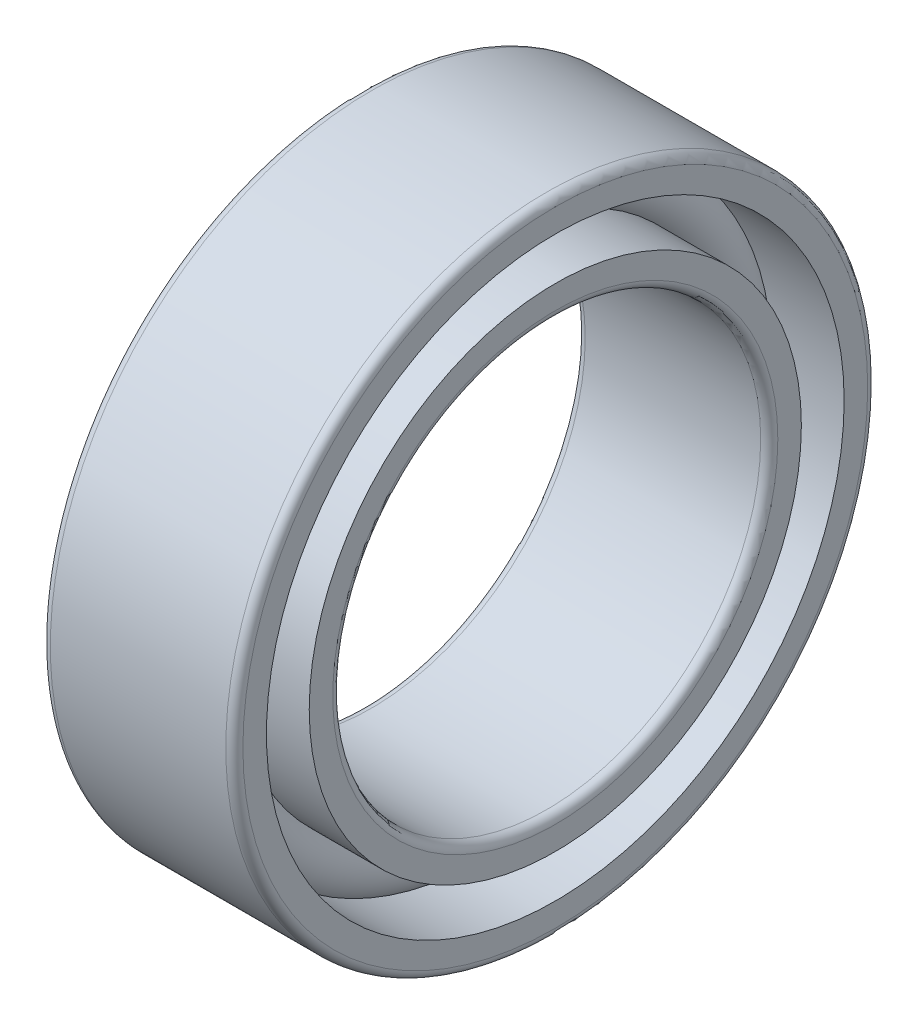
ISO-10303-21;
HEADER;
FILE_DESCRIPTION(('STEP AP214'),'2;1');
FILE_NAME('part.step','',(''),(''),'','','');
FILE_SCHEMA(('AUTOMOTIVE_DESIGN { 1 0 10303 214 1 1 1 1 }'));
ENDSEC;
DATA;
#1=APPLICATION_CONTEXT('core data for automotive mechanical design processes');
#2=APPLICATION_PROTOCOL_DEFINITION('international standard','automotive_design',2000,#1);
#3=PRODUCT_CONTEXT('',#1,'mechanical');
#4=PRODUCT('Part','Part','',(#3));
#5=PRODUCT_RELATED_PRODUCT_CATEGORY('part','',(#4));
#6=PRODUCT_DEFINITION_FORMATION('','',#4);
#7=PRODUCT_DEFINITION_CONTEXT('part definition',#1,'design');
#8=PRODUCT_DEFINITION('design','',#6,#7);
#9=PRODUCT_DEFINITION_SHAPE('','',#8);
#10=(LENGTH_UNIT() NAMED_UNIT(*) SI_UNIT(.MILLI.,.METRE.));
#11=(NAMED_UNIT(*) PLANE_ANGLE_UNIT() SI_UNIT($,.RADIAN.));
#12=(NAMED_UNIT(*) SI_UNIT($,.STERADIAN.) SOLID_ANGLE_UNIT());
#13=UNCERTAINTY_MEASURE_WITH_UNIT(LENGTH_MEASURE(1.E-05),#10,'distance_accuracy_value','');
#14=(GEOMETRIC_REPRESENTATION_CONTEXT(3) GLOBAL_UNCERTAINTY_ASSIGNED_CONTEXT((#13)) GLOBAL_UNIT_ASSIGNED_CONTEXT((#10,
#11,#12)) REPRESENTATION_CONTEXT('',''));
#15=CARTESIAN_POINT('',(0.,0.,0.));
#16=DIRECTION('',(0.,0.,1.));
#17=DIRECTION('',(1.,0.,0.));
#18=AXIS2_PLACEMENT_3D('',#15,#16,#17);
#19=CARTESIAN_POINT('',(0.,0.,0.));
#20=DIRECTION('',(-1.,0.,0.));
#21=DIRECTION('',(0.,0.,1.));
#22=AXIS2_PLACEMENT_3D('',#19,#20,#21);
#23=TOROIDAL_SURFACE('',#22,6.25,0.75);
#24=CARTESIAN_POINT('',(0.559016994374941,0.,0.));
#25=DIRECTION('',(-1.,0.,0.));
#26=DIRECTION('',(0.,0.,1.));
#27=AXIS2_PLACEMENT_3D('',#24,#25,#26);
#28=CIRCLE('',#27,6.75000000000001);
#29=CARTESIAN_POINT('',(0.559016994374941,0.,6.75000000000001));
#30=VERTEX_POINT('',#29);
#31=EDGE_CURVE('E41',#30,#30,#28,.F.);
#32=ORIENTED_EDGE('',*,*,#31,.T.);
#33=EDGE_LOOP('',(#32));
#34=FACE_BOUND('',#33,.T.);
#35=CARTESIAN_POINT('',(0.559016994374947,0.,0.));
#36=DIRECTION('',(-1.,0.,0.));
#37=DIRECTION('',(0.,0.,1.));
#38=AXIS2_PLACEMENT_3D('',#35,#36,#37);
#39=CIRCLE('',#38,5.75);
#40=CARTESIAN_POINT('',(0.559016994374947,0.,5.75));
#41=VERTEX_POINT('',#40);
#42=EDGE_CURVE('E10',#41,#41,#39,.T.);
#43=ORIENTED_EDGE('',*,*,#42,.T.);
#44=EDGE_LOOP('',(#43));
#45=FACE_BOUND('',#44,.T.);
#46=ADVANCED_FACE('F37',(#34,#45),#23,.T.);
#47=CARTESIAN_POINT('',(-20.6375,0.,0.));
#48=DIRECTION('',(1.,0.,0.));
#49=DIRECTION('',(0.,0.,-1.));
#50=AXIS2_PLACEMENT_3D('',#47,#48,#49);
#51=CYLINDRICAL_SURFACE('',#50,5.75);
#52=CARTESIAN_POINT('',(2.25,0.,0.));
#53=DIRECTION('',(1.,0.,0.));
#54=DIRECTION('',(0.,0.,-1.));
#55=AXIS2_PLACEMENT_3D('',#52,#53,#54);
#56=CIRCLE('',#55,5.75);
#57=CARTESIAN_POINT('',(2.25,0.,-5.75));
#58=VERTEX_POINT('',#57);
#59=EDGE_CURVE('E50',#58,#58,#56,.T.);
#60=ORIENTED_EDGE('',*,*,#59,.F.);
#61=EDGE_LOOP('',(#60));
#62=FACE_BOUND('',#61,.T.);
#63=ORIENTED_EDGE('',*,*,#42,.F.);
#64=EDGE_LOOP('',(#63));
#65=FACE_BOUND('',#64,.T.);
#66=ADVANCED_FACE('F89',(#62,#65),#51,.T.);
#67=CARTESIAN_POINT('',(-20.6375,0.,0.));
#68=DIRECTION('',(1.,0.,0.));
#69=DIRECTION('',(0.,0.,-1.));
#70=AXIS2_PLACEMENT_3D('',#67,#68,#69);
#71=CYLINDRICAL_SURFACE('',#70,5.75);
#72=CARTESIAN_POINT('',(-2.25,0.,0.));
#73=DIRECTION('',(1.,0.,0.));
#74=DIRECTION('',(0.,0.,-1.));
#75=AXIS2_PLACEMENT_3D('',#72,#73,#74);
#76=CIRCLE('',#75,5.75);
#77=CARTESIAN_POINT('',(-2.25,0.,-5.75));
#78=VERTEX_POINT('',#77);
#79=EDGE_CURVE('E59',#78,#78,#76,.T.);
#80=ORIENTED_EDGE('',*,*,#79,.T.);
#81=EDGE_LOOP('',(#80));
#82=FACE_BOUND('',#81,.T.);
#83=CARTESIAN_POINT('',(-0.559016994374947,0.,0.));
#84=DIRECTION('',(1.,0.,0.));
#85=DIRECTION('',(0.,0.,-1.));
#86=AXIS2_PLACEMENT_3D('',#83,#84,#85);
#87=CIRCLE('',#86,5.75);
#88=CARTESIAN_POINT('',(-0.559016994374947,0.,-5.75));
#89=VERTEX_POINT('',#88);
#90=EDGE_CURVE('E45',#89,#89,#87,.T.);
#91=ORIENTED_EDGE('',*,*,#90,.F.);
#92=EDGE_LOOP('',(#91));
#93=FACE_BOUND('',#92,.T.);
#94=ADVANCED_FACE('F92',(#82,#93),#71,.T.);
#95=CARTESIAN_POINT('',(2.25,5.2,0.));
#96=DIRECTION('',(1.,0.,0.));
#97=DIRECTION('',(0.,0.,-1.));
#98=AXIS2_PLACEMENT_3D('',#95,#96,#97);
#99=PLANE('',#98);
#100=ORIENTED_EDGE('',*,*,#59,.T.);
#101=EDGE_LOOP('',(#100));
#102=FACE_BOUND('',#101,.T.);
#103=CARTESIAN_POINT('',(2.25,0.,0.));
#104=DIRECTION('',(1.,0.,0.));
#105=DIRECTION('',(0.,0.,-1.));
#106=AXIS2_PLACEMENT_3D('',#103,#104,#105);
#107=CIRCLE('',#106,5.2);
#108=CARTESIAN_POINT('',(2.25,0.,-5.2));
#109=VERTEX_POINT('',#108);
#110=EDGE_CURVE('E81',#109,#109,#107,.T.);
#111=ORIENTED_EDGE('',*,*,#110,.F.);
#112=EDGE_LOOP('',(#111));
#113=FACE_BOUND('',#112,.T.);
#114=ADVANCED_FACE('F86',(#102,#113),#99,.T.);
#115=CARTESIAN_POINT('',(2.05,0.,0.));
#116=DIRECTION('',(1.,0.,0.));
#117=DIRECTION('',(0.,0.,-1.));
#118=AXIS2_PLACEMENT_3D('',#115,#116,#117);
#119=TOROIDAL_SURFACE('',#118,5.2,0.200000000000003);
#120=ORIENTED_EDGE('',*,*,#110,.T.);
#121=EDGE_LOOP('',(#120));
#122=FACE_BOUND('',#121,.T.);
#123=CARTESIAN_POINT('',(2.05,0.,0.));
#124=DIRECTION('',(1.,0.,0.));
#125=DIRECTION('',(0.,0.,-1.));
#126=AXIS2_PLACEMENT_3D('',#123,#124,#125);
#127=CIRCLE('',#126,5.);
#128=CARTESIAN_POINT('',(2.05,0.,-5.));
#129=VERTEX_POINT('',#128);
#130=EDGE_CURVE('E78',#129,#129,#127,.T.);
#131=ORIENTED_EDGE('',*,*,#130,.F.);
#132=EDGE_LOOP('',(#131));
#133=FACE_BOUND('',#132,.T.);
#134=ADVANCED_FACE('F103',(#122,#133),#119,.T.);
#135=CARTESIAN_POINT('',(-20.6375,0.,0.));
#136=DIRECTION('',(1.,0.,0.));
#137=DIRECTION('',(0.,0.,-1.));
#138=AXIS2_PLACEMENT_3D('',#135,#136,#137);
#139=CYLINDRICAL_SURFACE('',#138,5.);
#140=ORIENTED_EDGE('',*,*,#130,.T.);
#141=EDGE_LOOP('',(#140));
#142=FACE_BOUND('',#141,.T.);
#143=CARTESIAN_POINT('',(-2.05,0.,0.));
#144=DIRECTION('',(1.,0.,0.));
#145=DIRECTION('',(0.,0.,-1.));
#146=AXIS2_PLACEMENT_3D('',#143,#144,#145);
#147=CIRCLE('',#146,5.);
#148=CARTESIAN_POINT('',(-2.05,0.,-5.));
#149=VERTEX_POINT('',#148);
#150=EDGE_CURVE('E75',#149,#149,#147,.T.);
#151=ORIENTED_EDGE('',*,*,#150,.F.);
#152=EDGE_LOOP('',(#151));
#153=FACE_BOUND('',#152,.T.);
#154=ADVANCED_FACE('F106',(#142,#153),#139,.F.);
#155=CARTESIAN_POINT('',(-2.05,0.,0.));
#156=DIRECTION('',(1.,0.,0.));
#157=DIRECTION('',(0.,0.,-1.));
#158=AXIS2_PLACEMENT_3D('',#155,#156,#157);
#159=TOROIDAL_SURFACE('',#158,5.2,0.200000000000003);
#160=ORIENTED_EDGE('',*,*,#150,.T.);
#161=EDGE_LOOP('',(#160));
#162=FACE_BOUND('',#161,.T.);
#163=CARTESIAN_POINT('',(-2.25,0.,0.));
#164=DIRECTION('',(1.,0.,0.));
#165=DIRECTION('',(0.,0.,-1.));
#166=AXIS2_PLACEMENT_3D('',#163,#164,#165);
#167=CIRCLE('',#166,5.2);
#168=CARTESIAN_POINT('',(-2.25,0.,-5.2));
#169=VERTEX_POINT('',#168);
#170=EDGE_CURVE('E72',#169,#169,#167,.T.);
#171=ORIENTED_EDGE('',*,*,#170,.F.);
#172=EDGE_LOOP('',(#171));
#173=FACE_BOUND('',#172,.T.);
#174=ADVANCED_FACE('F110',(#162,#173),#159,.T.);
#175=CARTESIAN_POINT('',(-2.25,5.75,0.));
#176=DIRECTION('',(-1.,0.,0.));
#177=DIRECTION('',(0.,0.,1.));
#178=AXIS2_PLACEMENT_3D('',#175,#176,#177);
#179=PLANE('',#178);
#180=ORIENTED_EDGE('',*,*,#170,.T.);
#181=EDGE_LOOP('',(#180));
#182=FACE_BOUND('',#181,.T.);
#183=ORIENTED_EDGE('',*,*,#79,.F.);
#184=EDGE_LOOP('',(#183));
#185=FACE_BOUND('',#184,.T.);
#186=ADVANCED_FACE('F114',(#182,#185),#179,.T.);
#187=CARTESIAN_POINT('',(-0.559016994374941,0.,0.));
#188=DIRECTION('',(1.,0.,0.));
#189=DIRECTION('',(0.,0.,-1.));
#190=AXIS2_PLACEMENT_3D('',#187,#188,#189);
#191=CIRCLE('',#190,6.75000000000001);
#192=CARTESIAN_POINT('',(-0.559016994374941,0.,-6.75000000000001));
#193=VERTEX_POINT('',#192);
#194=EDGE_CURVE('E53',#193,#193,#191,.F.);
#195=ORIENTED_EDGE('',*,*,#194,.T.);
#196=EDGE_LOOP('',(#195));
#197=FACE_BOUND('',#196,.T.);
#198=ORIENTED_EDGE('',*,*,#90,.T.);
#199=EDGE_LOOP('',(#198));
#200=FACE_BOUND('',#199,.T.);
#201=ADVANCED_FACE('F39',(#197,#200),#23,.T.);
#202=CARTESIAN_POINT('',(-20.6375,0.,0.));
#203=DIRECTION('',(1.,0.,0.));
#204=DIRECTION('',(0.,0.,-1.));
#205=AXIS2_PLACEMENT_3D('',#202,#203,#204);
#206=CYLINDRICAL_SURFACE('',#205,6.75000000000001);
#207=CARTESIAN_POINT('',(2.25000000000001,0.,0.));
#208=DIRECTION('',(1.,0.,0.));
#209=DIRECTION('',(0.,0.,-1.));
#210=AXIS2_PLACEMENT_3D('',#207,#208,#209);
#211=CIRCLE('',#210,6.75000000000001);
#212=CARTESIAN_POINT('',(2.25000000000001,0.,-6.75000000000001));
#213=VERTEX_POINT('',#212);
#214=EDGE_CURVE('E55',#213,#213,#211,.T.);
#215=ORIENTED_EDGE('',*,*,#214,.T.);
#216=EDGE_LOOP('',(#215));
#217=FACE_BOUND('',#216,.T.);
#218=ORIENTED_EDGE('',*,*,#31,.F.);
#219=EDGE_LOOP('',(#218));
#220=FACE_BOUND('',#219,.T.);
#221=ADVANCED_FACE('F119',(#217,#220),#206,.F.);
#222=CARTESIAN_POINT('',(-20.6375,0.,0.));
#223=DIRECTION('',(1.,0.,0.));
#224=DIRECTION('',(0.,0.,-1.));
#225=AXIS2_PLACEMENT_3D('',#222,#223,#224);
#226=CYLINDRICAL_SURFACE('',#225,6.75000000000001);
#227=CARTESIAN_POINT('',(-2.25000000000001,0.,0.));
#228=DIRECTION('',(1.,0.,0.));
#229=DIRECTION('',(0.,0.,-1.));
#230=AXIS2_PLACEMENT_3D('',#227,#228,#229);
#231=CIRCLE('',#230,6.75000000000001);
#232=CARTESIAN_POINT('',(-2.25000000000001,0.,-6.75000000000001));
#233=VERTEX_POINT('',#232);
#234=EDGE_CURVE('E150',#233,#233,#231,.T.);
#235=ORIENTED_EDGE('',*,*,#234,.F.);
#236=EDGE_LOOP('',(#235));
#237=FACE_BOUND('',#236,.T.);
#238=ORIENTED_EDGE('',*,*,#194,.F.);
#239=EDGE_LOOP('',(#238));
#240=FACE_BOUND('',#239,.T.);
#241=ADVANCED_FACE('F122',(#237,#240),#226,.F.);
#242=CARTESIAN_POINT('',(2.25000000000001,7.30000000000001,0.));
#243=DIRECTION('',(1.,0.,0.));
#244=DIRECTION('',(0.,0.,-1.));
#245=AXIS2_PLACEMENT_3D('',#242,#243,#244);
#246=PLANE('',#245);
#247=CARTESIAN_POINT('',(2.25000000000001,0.,0.));
#248=DIRECTION('',(1.,0.,0.));
#249=DIRECTION('',(0.,0.,-1.));
#250=AXIS2_PLACEMENT_3D('',#247,#248,#249);
#251=CIRCLE('',#250,7.30000000000001);
#252=CARTESIAN_POINT('',(2.25000000000001,0.,-7.30000000000001));
#253=VERTEX_POINT('',#252);
#254=EDGE_CURVE('E61',#253,#253,#251,.T.);
#255=ORIENTED_EDGE('',*,*,#254,.T.);
#256=EDGE_LOOP('',(#255));
#257=FACE_BOUND('',#256,.T.);
#258=ORIENTED_EDGE('',*,*,#214,.F.);
#259=EDGE_LOOP('',(#258));
#260=FACE_BOUND('',#259,.T.);
#261=ADVANCED_FACE('F123',(#257,#260),#246,.T.);
#262=CARTESIAN_POINT('',(2.05,0.,0.));
#263=DIRECTION('',(1.,0.,0.));
#264=DIRECTION('',(0.,0.,-1.));
#265=AXIS2_PLACEMENT_3D('',#262,#263,#264);
#266=TOROIDAL_SURFACE('',#265,7.30000000000001,0.200000000000003);
#267=CARTESIAN_POINT('',(2.05,0.,0.));
#268=DIRECTION('',(1.,0.,0.));
#269=DIRECTION('',(0.,0.,-1.));
#270=AXIS2_PLACEMENT_3D('',#267,#268,#269);
#271=CIRCLE('',#270,7.50000000000001);
#272=CARTESIAN_POINT('',(2.05,0.,-7.50000000000001));
#273=VERTEX_POINT('',#272);
#274=EDGE_CURVE('E66',#273,#273,#271,.T.);
#275=ORIENTED_EDGE('',*,*,#274,.T.);
#276=EDGE_LOOP('',(#275));
#277=FACE_BOUND('',#276,.T.);
#278=ORIENTED_EDGE('',*,*,#254,.F.);
#279=EDGE_LOOP('',(#278));
#280=FACE_BOUND('',#279,.T.);
#281=ADVANCED_FACE('F126',(#277,#280),#266,.T.);
#282=CARTESIAN_POINT('',(-20.6375,0.,0.));
#283=DIRECTION('',(1.,0.,0.));
#284=DIRECTION('',(0.,0.,-1.));
#285=AXIS2_PLACEMENT_3D('',#282,#283,#284);
#286=CYLINDRICAL_SURFACE('',#285,7.50000000000001);
#287=CARTESIAN_POINT('',(-2.05,0.,0.));
#288=DIRECTION('',(1.,0.,0.));
#289=DIRECTION('',(0.,0.,-1.));
#290=AXIS2_PLACEMENT_3D('',#287,#288,#289);
#291=CIRCLE('',#290,7.50000000000001);
#292=CARTESIAN_POINT('',(-2.05,0.,-7.50000000000001));
#293=VERTEX_POINT('',#292);
#294=EDGE_CURVE('E154',#293,#293,#291,.T.);
#295=ORIENTED_EDGE('',*,*,#294,.T.);
#296=EDGE_LOOP('',(#295));
#297=FACE_BOUND('',#296,.T.);
#298=ORIENTED_EDGE('',*,*,#274,.F.);
#299=EDGE_LOOP('',(#298));
#300=FACE_BOUND('',#299,.T.);
#301=ADVANCED_FACE('F130',(#297,#300),#286,.T.);
#302=CARTESIAN_POINT('',(-2.05,0.,0.));
#303=DIRECTION('',(1.,0.,0.));
#304=DIRECTION('',(0.,0.,-1.));
#305=AXIS2_PLACEMENT_3D('',#302,#303,#304);
#306=TOROIDAL_SURFACE('',#305,7.30000000000001,0.200000000000003);
#307=CARTESIAN_POINT('',(-2.25000000000001,0.,0.));
#308=DIRECTION('',(1.,0.,0.));
#309=DIRECTION('',(0.,0.,-1.));
#310=AXIS2_PLACEMENT_3D('',#307,#308,#309);
#311=CIRCLE('',#310,7.30000000000001);
#312=CARTESIAN_POINT('',(-2.25000000000001,0.,-7.30000000000001));
#313=VERTEX_POINT('',#312);
#314=EDGE_CURVE('E151',#313,#313,#311,.T.);
#315=ORIENTED_EDGE('',*,*,#314,.T.);
#316=EDGE_LOOP('',(#315));
#317=FACE_BOUND('',#316,.T.);
#318=ORIENTED_EDGE('',*,*,#294,.F.);
#319=EDGE_LOOP('',(#318));
#320=FACE_BOUND('',#319,.T.);
#321=ADVANCED_FACE('F134',(#317,#320),#306,.T.);
#322=CARTESIAN_POINT('',(-2.25,6.75000000000001,0.));
#323=DIRECTION('',(-1.,0.,0.));
#324=DIRECTION('',(0.,0.,1.));
#325=AXIS2_PLACEMENT_3D('',#322,#323,#324);
#326=PLANE('',#325);
#327=ORIENTED_EDGE('',*,*,#234,.T.);
#328=EDGE_LOOP('',(#327));
#329=FACE_BOUND('',#328,.T.);
#330=ORIENTED_EDGE('',*,*,#314,.F.);
#331=EDGE_LOOP('',(#330));
#332=FACE_BOUND('',#331,.T.);
#333=ADVANCED_FACE('F138',(#329,#332),#326,.T.);
#334=CLOSED_SHELL('',(#46,#66,#94,#114,#134,#154,#174,#186,#201,#221,#241,#261,#281,#301,#321,#333));
#335=MANIFOLD_SOLID_BREP('B2',#334);
#336=ADVANCED_BREP_SHAPE_REPRESENTATION('',(#18,#335),#14);
#337=SHAPE_DEFINITION_REPRESENTATION(#9,#336);
ENDSEC;
END-ISO-10303-21;
